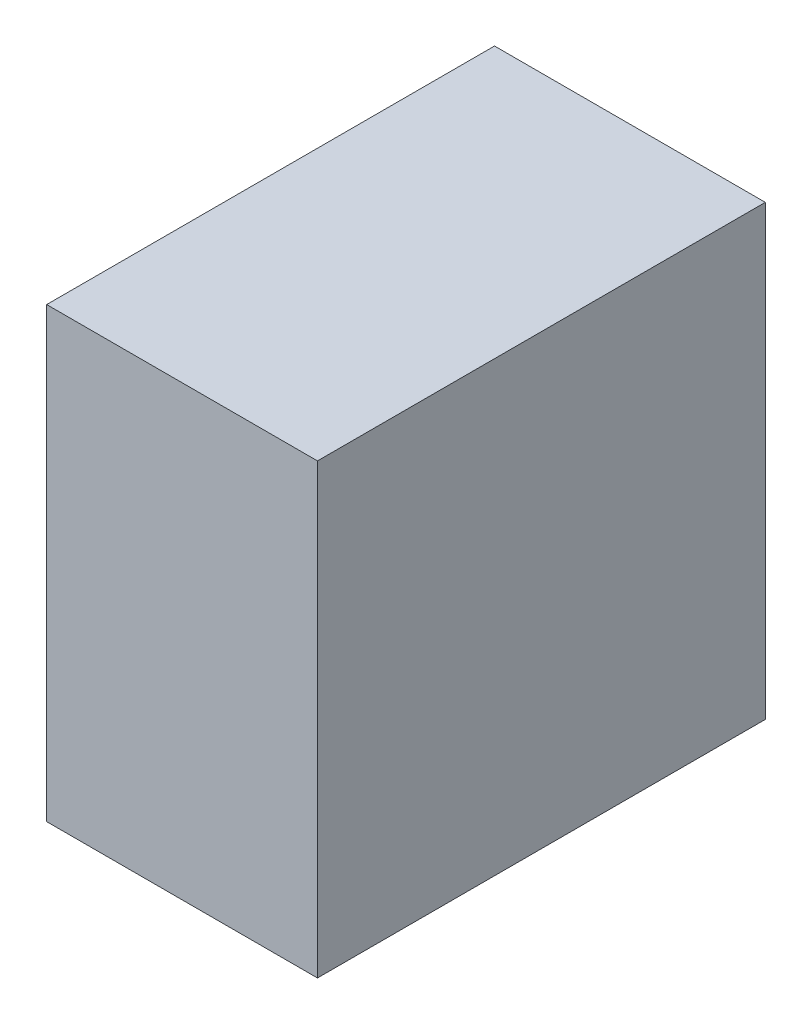
ISO-10303-21;
HEADER;
FILE_DESCRIPTION(('STEP AP214'),'2;1');
FILE_NAME('part.step','',(''),(''),'','','');
FILE_SCHEMA(('AUTOMOTIVE_DESIGN { 1 0 10303 214 1 1 1 1 }'));
ENDSEC;
DATA;
#1=APPLICATION_CONTEXT('core data for automotive mechanical design processes');
#2=APPLICATION_PROTOCOL_DEFINITION('international standard','automotive_design',2000,#1);
#3=PRODUCT_CONTEXT('',#1,'mechanical');
#4=PRODUCT('Part','Part','',(#3));
#5=PRODUCT_RELATED_PRODUCT_CATEGORY('part','',(#4));
#6=PRODUCT_DEFINITION_FORMATION('','',#4);
#7=PRODUCT_DEFINITION_CONTEXT('part definition',#1,'design');
#8=PRODUCT_DEFINITION('design','',#6,#7);
#9=PRODUCT_DEFINITION_SHAPE('','',#8);
#10=(LENGTH_UNIT() NAMED_UNIT(*) SI_UNIT(.MILLI.,.METRE.));
#11=(NAMED_UNIT(*) PLANE_ANGLE_UNIT() SI_UNIT($,.RADIAN.));
#12=(NAMED_UNIT(*) SI_UNIT($,.STERADIAN.) SOLID_ANGLE_UNIT());
#13=UNCERTAINTY_MEASURE_WITH_UNIT(LENGTH_MEASURE(1.E-05),#10,'distance_accuracy_value','');
#14=(GEOMETRIC_REPRESENTATION_CONTEXT(3) GLOBAL_UNCERTAINTY_ASSIGNED_CONTEXT((#13)) GLOBAL_UNIT_ASSIGNED_CONTEXT((#10,
#11,#12)) REPRESENTATION_CONTEXT('',''));
#15=CARTESIAN_POINT('',(0.,0.,0.));
#16=DIRECTION('',(0.,0.,1.));
#17=DIRECTION('',(1.,0.,0.));
#18=AXIS2_PLACEMENT_3D('',#15,#16,#17);
#19=CARTESIAN_POINT('',(13.,21.5,43.));
#20=DIRECTION('',(-1.,0.,0.));
#21=DIRECTION('',(0.,0.,1.));
#22=AXIS2_PLACEMENT_3D('',#19,#20,#21);
#23=PLANE('',#22);
#24=DIRECTION('',(0.,1.,0.));
#25=VECTOR('',#24,1.);
#26=CARTESIAN_POINT('',(13.,21.5,0.));
#27=LINE('',#26,#25);
#28=CARTESIAN_POINT('',(13.,-21.5,0.));
#29=VERTEX_POINT('',#28);
#30=CARTESIAN_POINT('',(13.,21.5,0.));
#31=VERTEX_POINT('',#30);
#32=EDGE_CURVE('E107',#29,#31,#27,.T.);
#33=ORIENTED_EDGE('',*,*,#32,.T.);
#34=DIRECTION('',(0.,0.,-1.));
#35=VECTOR('',#34,1.);
#36=CARTESIAN_POINT('',(13.,21.5,43.));
#37=LINE('',#36,#35);
#38=CARTESIAN_POINT('',(13.,21.5,43.));
#39=VERTEX_POINT('',#38);
#40=EDGE_CURVE('E11',#39,#31,#37,.T.);
#41=ORIENTED_EDGE('',*,*,#40,.F.);
#42=DIRECTION('',(0.,1.,0.));
#43=VECTOR('',#42,1.);
#44=CARTESIAN_POINT('',(13.,21.5,43.));
#45=LINE('',#44,#43);
#46=CARTESIAN_POINT('',(13.,-21.5,43.));
#47=VERTEX_POINT('',#46);
#48=EDGE_CURVE('E91',#47,#39,#45,.T.);
#49=ORIENTED_EDGE('',*,*,#48,.F.);
#50=DIRECTION('',(0.,0.,-1.));
#51=VECTOR('',#50,1.);
#52=CARTESIAN_POINT('',(13.,-21.5,43.));
#53=LINE('',#52,#51);
#54=EDGE_CURVE('E103',#47,#29,#53,.T.);
#55=ORIENTED_EDGE('',*,*,#54,.T.);
#56=EDGE_LOOP('',(#33,#41,#49,#55));
#57=FACE_BOUND('',#56,.T.);
#58=ADVANCED_FACE('F39',(#57),#23,.F.);
#59=CARTESIAN_POINT('',(-13.,21.5,43.));
#60=DIRECTION('',(0.,-1.,0.));
#61=DIRECTION('',(0.,0.,-1.));
#62=AXIS2_PLACEMENT_3D('',#59,#60,#61);
#63=PLANE('',#62);
#64=DIRECTION('',(-1.,0.,0.));
#65=VECTOR('',#64,1.);
#66=CARTESIAN_POINT('',(-13.,21.5,0.));
#67=LINE('',#66,#65);
#68=CARTESIAN_POINT('',(-13.,21.5,0.));
#69=VERTEX_POINT('',#68);
#70=EDGE_CURVE('E96',#31,#69,#67,.T.);
#71=ORIENTED_EDGE('',*,*,#70,.T.);
#72=DIRECTION('',(0.,0.,-1.));
#73=VECTOR('',#72,1.);
#74=CARTESIAN_POINT('',(-13.,21.5,43.));
#75=LINE('',#74,#73);
#76=CARTESIAN_POINT('',(-13.,21.5,43.));
#77=VERTEX_POINT('',#76);
#78=EDGE_CURVE('E48',#77,#69,#75,.T.);
#79=ORIENTED_EDGE('',*,*,#78,.F.);
#80=DIRECTION('',(-1.,0.,0.));
#81=VECTOR('',#80,1.);
#82=CARTESIAN_POINT('',(-13.,21.5,43.));
#83=LINE('',#82,#81);
#84=EDGE_CURVE('E86',#39,#77,#83,.T.);
#85=ORIENTED_EDGE('',*,*,#84,.F.);
#86=ORIENTED_EDGE('',*,*,#40,.T.);
#87=EDGE_LOOP('',(#71,#79,#85,#86));
#88=FACE_BOUND('',#87,.T.);
#89=ADVANCED_FACE('F95',(#88),#63,.F.);
#90=CARTESIAN_POINT('',(-13.,21.5,43.));
#91=DIRECTION('',(1.,0.,0.));
#92=DIRECTION('',(0.,0.,-1.));
#93=AXIS2_PLACEMENT_3D('',#90,#91,#92);
#94=PLANE('',#93);
#95=DIRECTION('',(0.,-1.,0.));
#96=VECTOR('',#95,1.);
#97=CARTESIAN_POINT('',(-13.,21.5,0.));
#98=LINE('',#97,#96);
#99=CARTESIAN_POINT('',(-13.,-21.5,0.));
#100=VERTEX_POINT('',#99);
#101=EDGE_CURVE('E73',#69,#100,#98,.T.);
#102=ORIENTED_EDGE('',*,*,#101,.T.);
#103=DIRECTION('',(0.,0.,-1.));
#104=VECTOR('',#103,1.);
#105=CARTESIAN_POINT('',(-13.,-21.5,43.));
#106=LINE('',#105,#104);
#107=CARTESIAN_POINT('',(-13.,-21.5,43.));
#108=VERTEX_POINT('',#107);
#109=EDGE_CURVE('E98',#108,#100,#106,.T.);
#110=ORIENTED_EDGE('',*,*,#109,.F.);
#111=DIRECTION('',(0.,-1.,0.));
#112=VECTOR('',#111,1.);
#113=CARTESIAN_POINT('',(-13.,21.5,43.));
#114=LINE('',#113,#112);
#115=EDGE_CURVE('E89',#77,#108,#114,.T.);
#116=ORIENTED_EDGE('',*,*,#115,.F.);
#117=ORIENTED_EDGE('',*,*,#78,.T.);
#118=EDGE_LOOP('',(#102,#110,#116,#117));
#119=FACE_BOUND('',#118,.T.);
#120=ADVANCED_FACE('F99',(#119),#94,.F.);
#121=CARTESIAN_POINT('',(-13.,-21.5,43.));
#122=DIRECTION('',(0.,1.,0.));
#123=DIRECTION('',(0.,0.,1.));
#124=AXIS2_PLACEMENT_3D('',#121,#122,#123);
#125=PLANE('',#124);
#126=DIRECTION('',(1.,0.,0.));
#127=VECTOR('',#126,1.);
#128=CARTESIAN_POINT('',(-13.,-21.5,0.));
#129=LINE('',#128,#127);
#130=EDGE_CURVE('E79',#100,#29,#129,.T.);
#131=ORIENTED_EDGE('',*,*,#130,.T.);
#132=ORIENTED_EDGE('',*,*,#54,.F.);
#133=DIRECTION('',(1.,0.,0.));
#134=VECTOR('',#133,1.);
#135=CARTESIAN_POINT('',(-13.,-21.5,43.));
#136=LINE('',#135,#134);
#137=EDGE_CURVE('E56',#108,#47,#136,.T.);
#138=ORIENTED_EDGE('',*,*,#137,.F.);
#139=ORIENTED_EDGE('',*,*,#109,.T.);
#140=EDGE_LOOP('',(#131,#132,#138,#139));
#141=FACE_BOUND('',#140,.T.);
#142=ADVANCED_FACE('F120',(#141),#125,.F.);
#143=CARTESIAN_POINT('',(0.,0.,43.));
#144=DIRECTION('',(0.,0.,1.));
#145=DIRECTION('',(1.,0.,0.));
#146=AXIS2_PLACEMENT_3D('',#143,#144,#145);
#147=PLANE('',#146);
#148=ORIENTED_EDGE('',*,*,#48,.T.);
#149=ORIENTED_EDGE('',*,*,#84,.T.);
#150=ORIENTED_EDGE('',*,*,#115,.T.);
#151=ORIENTED_EDGE('',*,*,#137,.T.);
#152=EDGE_LOOP('',(#148,#149,#150,#151));
#153=FACE_BOUND('',#152,.T.);
#154=ADVANCED_FACE('F87',(#153),#147,.T.);
#155=CARTESIAN_POINT('',(0.,0.,0.));
#156=DIRECTION('',(0.,0.,1.));
#157=DIRECTION('',(1.,0.,0.));
#158=AXIS2_PLACEMENT_3D('',#155,#156,#157);
#159=PLANE('',#158);
#160=ORIENTED_EDGE('',*,*,#32,.F.);
#161=ORIENTED_EDGE('',*,*,#130,.F.);
#162=ORIENTED_EDGE('',*,*,#101,.F.);
#163=ORIENTED_EDGE('',*,*,#70,.F.);
#164=EDGE_LOOP('',(#160,#161,#162,#163));
#165=FACE_BOUND('',#164,.T.);
#166=ADVANCED_FACE('F123',(#165),#159,.F.);
#167=CLOSED_SHELL('',(#58,#89,#120,#142,#154,#166));
#168=MANIFOLD_SOLID_BREP('B2',#167);
#169=ADVANCED_BREP_SHAPE_REPRESENTATION('',(#18,#168),#14);
#170=SHAPE_DEFINITION_REPRESENTATION(#9,#169);
ENDSEC;
END-ISO-10303-21;
